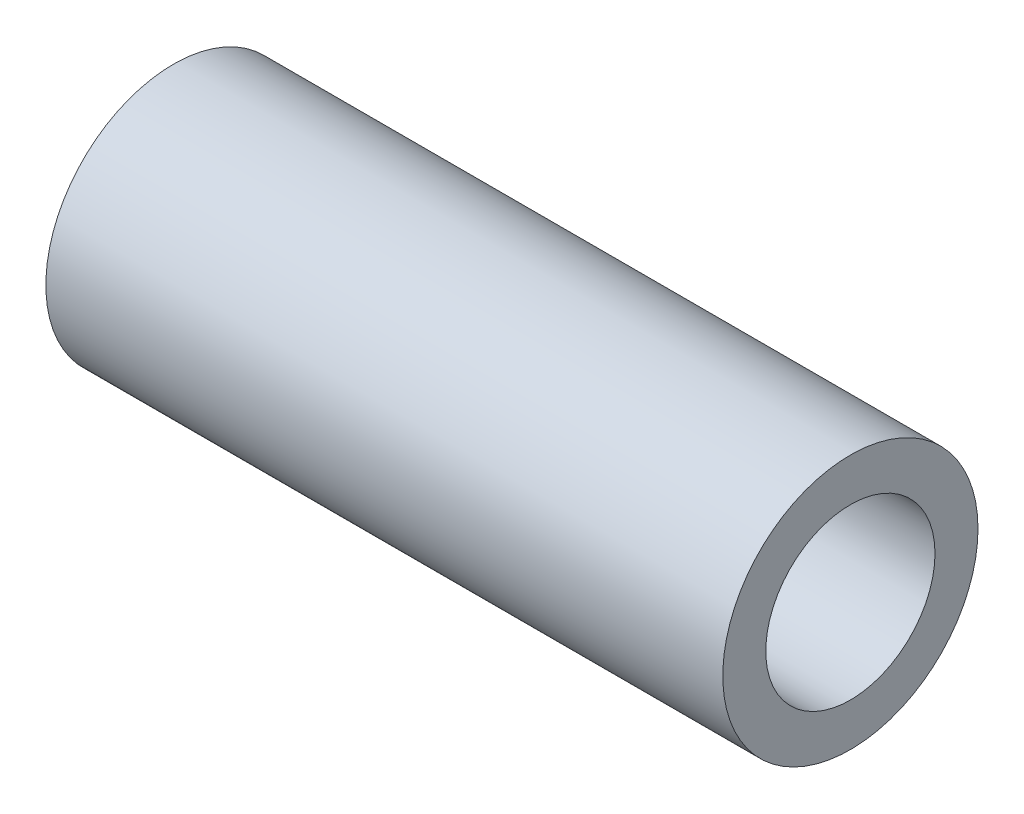
ISO-10303-21;
HEADER;
FILE_DESCRIPTION(('STEP AP214'),'2;1');
FILE_NAME('part.step','',(''),(''),'','','');
FILE_SCHEMA(('AUTOMOTIVE_DESIGN { 1 0 10303 214 1 1 1 1 }'));
ENDSEC;
DATA;
#1=APPLICATION_CONTEXT('core data for automotive mechanical design processes');
#2=APPLICATION_PROTOCOL_DEFINITION('international standard','automotive_design',2000,#1);
#3=PRODUCT_CONTEXT('',#1,'mechanical');
#4=PRODUCT('Part','Part','',(#3));
#5=PRODUCT_RELATED_PRODUCT_CATEGORY('part','',(#4));
#6=PRODUCT_DEFINITION_FORMATION('','',#4);
#7=PRODUCT_DEFINITION_CONTEXT('part definition',#1,'design');
#8=PRODUCT_DEFINITION('design','',#6,#7);
#9=PRODUCT_DEFINITION_SHAPE('','',#8);
#10=(LENGTH_UNIT() NAMED_UNIT(*) SI_UNIT(.MILLI.,.METRE.));
#11=(NAMED_UNIT(*) PLANE_ANGLE_UNIT() SI_UNIT($,.RADIAN.));
#12=(NAMED_UNIT(*) SI_UNIT($,.STERADIAN.) SOLID_ANGLE_UNIT());
#13=UNCERTAINTY_MEASURE_WITH_UNIT(LENGTH_MEASURE(1.E-05),#10,'distance_accuracy_value','');
#14=(GEOMETRIC_REPRESENTATION_CONTEXT(3) GLOBAL_UNCERTAINTY_ASSIGNED_CONTEXT((#13)) GLOBAL_UNIT_ASSIGNED_CONTEXT((#10,
#11,#12)) REPRESENTATION_CONTEXT('',''));
#15=CARTESIAN_POINT('',(0.,0.,0.));
#16=DIRECTION('',(0.,0.,1.));
#17=DIRECTION('',(1.,0.,0.));
#18=AXIS2_PLACEMENT_3D('',#15,#16,#17);
#19=CARTESIAN_POINT('',(70.4,-46.302,0.));
#20=DIRECTION('',(-1.,0.,0.));
#21=DIRECTION('',(0.,0.,1.));
#22=AXIS2_PLACEMENT_3D('',#19,#20,#21);
#23=CYLINDRICAL_SURFACE('',#22,3.175);
#24=CARTESIAN_POINT('',(70.4,-46.302,0.));
#25=DIRECTION('',(1.,0.,0.));
#26=DIRECTION('',(0.,0.,-1.));
#27=AXIS2_PLACEMENT_3D('',#24,#25,#26);
#28=CIRCLE('',#27,3.175);
#29=CARTESIAN_POINT('',(70.4,-46.302,-3.17500000000001));
#30=VERTEX_POINT('',#29);
#31=EDGE_CURVE('E23',#30,#30,#28,.T.);
#32=ORIENTED_EDGE('',*,*,#31,.T.);
#33=EDGE_LOOP('',(#32));
#34=FACE_BOUND('',#33,.T.);
#35=CARTESIAN_POINT('',(45.,-46.302,0.));
#36=DIRECTION('',(1.,0.,0.));
#37=DIRECTION('',(0.,0.,-1.));
#38=AXIS2_PLACEMENT_3D('',#35,#36,#37);
#39=CIRCLE('',#38,3.175);
#40=CARTESIAN_POINT('',(45.,-46.302,-3.17500000000001));
#41=VERTEX_POINT('',#40);
#42=EDGE_CURVE('E34',#41,#41,#39,.T.);
#43=ORIENTED_EDGE('',*,*,#42,.F.);
#44=EDGE_LOOP('',(#43));
#45=FACE_BOUND('',#44,.T.);
#46=ADVANCED_FACE('F15',(#34,#45),#23,.F.);
#47=CARTESIAN_POINT('',(70.4,-46.302,0.));
#48=DIRECTION('',(-1.,0.,0.));
#49=DIRECTION('',(0.,0.,1.));
#50=AXIS2_PLACEMENT_3D('',#47,#48,#49);
#51=CYLINDRICAL_SURFACE('',#50,4.7879);
#52=CARTESIAN_POINT('',(70.4,-46.302,0.));
#53=DIRECTION('',(1.,0.,0.));
#54=DIRECTION('',(0.,0.,-1.));
#55=AXIS2_PLACEMENT_3D('',#52,#53,#54);
#56=CIRCLE('',#55,4.7879);
#57=CARTESIAN_POINT('',(70.4,-46.302,-4.78790000000001));
#58=VERTEX_POINT('',#57);
#59=EDGE_CURVE('E10',#58,#58,#56,.T.);
#60=ORIENTED_EDGE('',*,*,#59,.F.);
#61=EDGE_LOOP('',(#60));
#62=FACE_BOUND('',#61,.T.);
#63=CARTESIAN_POINT('',(45.,-46.302,0.));
#64=DIRECTION('',(1.,0.,0.));
#65=DIRECTION('',(0.,0.,-1.));
#66=AXIS2_PLACEMENT_3D('',#63,#64,#65);
#67=CIRCLE('',#66,4.7879);
#68=CARTESIAN_POINT('',(45.,-46.302,-4.78790000000001));
#69=VERTEX_POINT('',#68);
#70=EDGE_CURVE('E18',#69,#69,#67,.T.);
#71=ORIENTED_EDGE('',*,*,#70,.T.);
#72=EDGE_LOOP('',(#71));
#73=FACE_BOUND('',#72,.T.);
#74=ADVANCED_FACE('F44',(#62,#73),#51,.T.);
#75=CARTESIAN_POINT('',(70.4,-46.302,0.));
#76=DIRECTION('',(1.,0.,0.));
#77=DIRECTION('',(0.,1.,0.));
#78=AXIS2_PLACEMENT_3D('',#75,#76,#77);
#79=PLANE('',#78);
#80=ORIENTED_EDGE('',*,*,#31,.F.);
#81=EDGE_LOOP('',(#80));
#82=FACE_BOUND('',#81,.T.);
#83=ORIENTED_EDGE('',*,*,#59,.T.);
#84=EDGE_LOOP('',(#83));
#85=FACE_BOUND('',#84,.T.);
#86=ADVANCED_FACE('F48',(#82,#85),#79,.T.);
#87=CARTESIAN_POINT('',(45.,-46.302,0.));
#88=DIRECTION('',(1.,0.,0.));
#89=DIRECTION('',(0.,1.,0.));
#90=AXIS2_PLACEMENT_3D('',#87,#88,#89);
#91=PLANE('',#90);
#92=ORIENTED_EDGE('',*,*,#42,.T.);
#93=EDGE_LOOP('',(#92));
#94=FACE_BOUND('',#93,.T.);
#95=ORIENTED_EDGE('',*,*,#70,.F.);
#96=EDGE_LOOP('',(#95));
#97=FACE_BOUND('',#96,.T.);
#98=ADVANCED_FACE('F46',(#94,#97),#91,.F.);
#99=CLOSED_SHELL('',(#46,#74,#86,#98));
#100=MANIFOLD_SOLID_BREP('B1',#99);
#101=ADVANCED_BREP_SHAPE_REPRESENTATION('',(#18,#100),#14);
#102=SHAPE_DEFINITION_REPRESENTATION(#9,#101);
ENDSEC;
END-ISO-10303-21;
